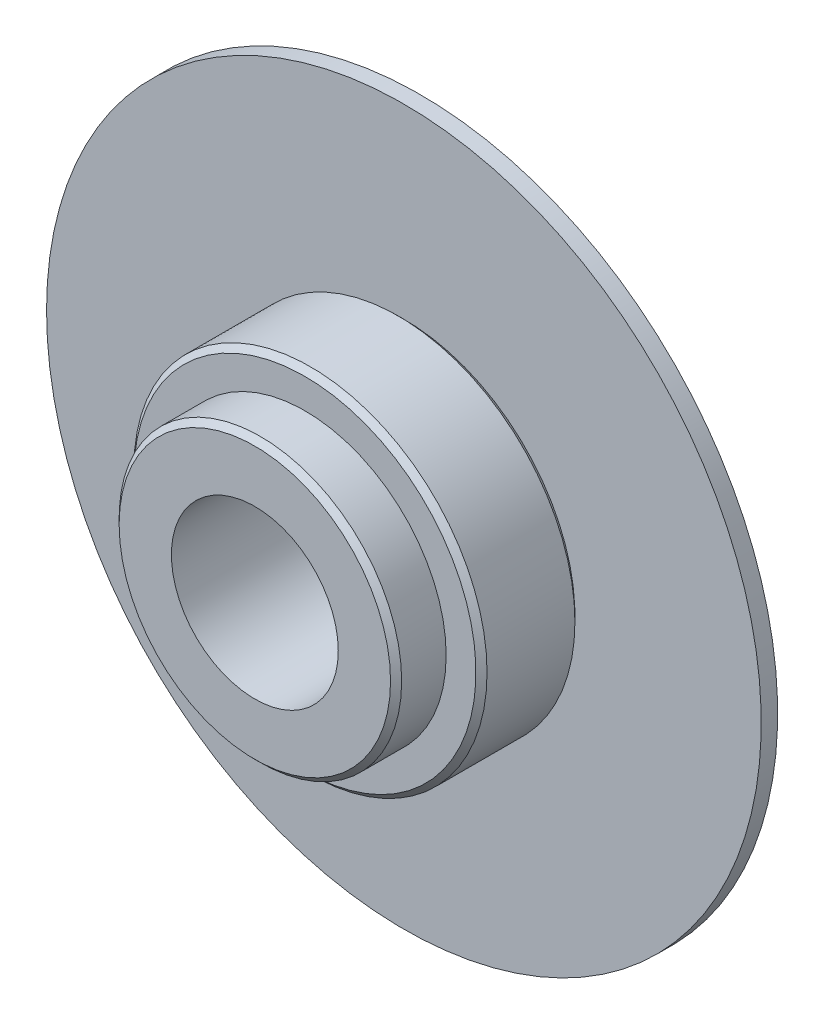
ISO-10303-21;
HEADER;
FILE_DESCRIPTION(('STEP AP214'),'2;1');
FILE_NAME('part.step','',(''),(''),'','','');
FILE_SCHEMA(('AUTOMOTIVE_DESIGN { 1 0 10303 214 1 1 1 1 }'));
ENDSEC;
DATA;
#1=APPLICATION_CONTEXT('core data for automotive mechanical design processes');
#2=APPLICATION_PROTOCOL_DEFINITION('international standard','automotive_design',2000,#1);
#3=PRODUCT_CONTEXT('',#1,'mechanical');
#4=PRODUCT('Part','Part','',(#3));
#5=PRODUCT_RELATED_PRODUCT_CATEGORY('part','',(#4));
#6=PRODUCT_DEFINITION_FORMATION('','',#4);
#7=PRODUCT_DEFINITION_CONTEXT('part definition',#1,'design');
#8=PRODUCT_DEFINITION('design','',#6,#7);
#9=PRODUCT_DEFINITION_SHAPE('','',#8);
#10=(LENGTH_UNIT() NAMED_UNIT(*) SI_UNIT(.MILLI.,.METRE.));
#11=(NAMED_UNIT(*) PLANE_ANGLE_UNIT() SI_UNIT($,.RADIAN.));
#12=(NAMED_UNIT(*) SI_UNIT($,.STERADIAN.) SOLID_ANGLE_UNIT());
#13=UNCERTAINTY_MEASURE_WITH_UNIT(LENGTH_MEASURE(1.E-05),#10,'distance_accuracy_value','');
#14=(GEOMETRIC_REPRESENTATION_CONTEXT(3) GLOBAL_UNCERTAINTY_ASSIGNED_CONTEXT((#13)) GLOBAL_UNIT_ASSIGNED_CONTEXT((#10,
#11,#12)) REPRESENTATION_CONTEXT('',''));
#15=CARTESIAN_POINT('',(0.,0.,0.));
#16=DIRECTION('',(0.,0.,1.));
#17=DIRECTION('',(1.,0.,0.));
#18=AXIS2_PLACEMENT_3D('',#15,#16,#17);
#19=CARTESIAN_POINT('',(0.,0.,-1.8));
#20=DIRECTION('',(0.,0.,1.));
#21=DIRECTION('',(1.,0.,0.));
#22=AXIS2_PLACEMENT_3D('',#19,#20,#21);
#23=CYLINDRICAL_SURFACE('',#22,5.08);
#24=CARTESIAN_POINT('',(0.,0.,-0.200000000000002));
#25=DIRECTION('',(0.,0.,1.));
#26=DIRECTION('',(1.,0.,0.));
#27=AXIS2_PLACEMENT_3D('',#24,#25,#26);
#28=CIRCLE('',#27,5.08);
#29=CARTESIAN_POINT('',(5.08,0.,-0.200000000000002));
#30=VERTEX_POINT('',#29);
#31=EDGE_CURVE('E47',#30,#30,#28,.F.);
#32=ORIENTED_EDGE('',*,*,#31,.T.);
#33=EDGE_LOOP('',(#32));
#34=FACE_BOUND('',#33,.T.);
#35=CARTESIAN_POINT('',(0.,0.,-1.8));
#36=DIRECTION('',(0.,0.,1.));
#37=DIRECTION('',(1.,0.,0.));
#38=AXIS2_PLACEMENT_3D('',#35,#36,#37);
#39=CIRCLE('',#38,5.08);
#40=CARTESIAN_POINT('',(5.08,0.,-1.8));
#41=VERTEX_POINT('',#40);
#42=EDGE_CURVE('E55',#41,#41,#39,.T.);
#43=ORIENTED_EDGE('',*,*,#42,.T.);
#44=EDGE_LOOP('',(#43));
#45=FACE_BOUND('',#44,.T.);
#46=ADVANCED_FACE('F34',(#34,#45),#23,.T.);
#47=CARTESIAN_POINT('',(0.,0.,0.));
#48=DIRECTION('',(0.,0.,1.));
#49=DIRECTION('',(1.,0.,0.));
#50=AXIS2_PLACEMENT_3D('',#47,#48,#49);
#51=PLANE('',#50);
#52=CARTESIAN_POINT('',(0.,0.,0.));
#53=DIRECTION('',(0.,0.,1.));
#54=DIRECTION('',(1.,0.,0.));
#55=AXIS2_PLACEMENT_3D('',#52,#53,#54);
#56=CIRCLE('',#55,3.);
#57=CARTESIAN_POINT('',(3.,0.,0.));
#58=VERTEX_POINT('',#57);
#59=EDGE_CURVE('E155',#58,#58,#56,.T.);
#60=ORIENTED_EDGE('',*,*,#59,.F.);
#61=EDGE_LOOP('',(#60));
#62=FACE_BOUND('',#61,.T.);
#63=CARTESIAN_POINT('',(0.,0.,0.));
#64=DIRECTION('',(0.,0.,1.));
#65=DIRECTION('',(1.,0.,0.));
#66=AXIS2_PLACEMENT_3D('',#63,#64,#65);
#67=CIRCLE('',#66,4.88);
#68=CARTESIAN_POINT('',(4.88,0.,0.));
#69=VERTEX_POINT('',#68);
#70=EDGE_CURVE('E70',#69,#69,#67,.T.);
#71=ORIENTED_EDGE('',*,*,#70,.T.);
#72=EDGE_LOOP('',(#71));
#73=FACE_BOUND('',#72,.T.);
#74=ADVANCED_FACE('F83',(#62,#73),#51,.T.);
#75=CARTESIAN_POINT('',(0.,0.,-5.36));
#76=DIRECTION('',(0.,0.,1.));
#77=DIRECTION('',(1.,0.,0.));
#78=AXIS2_PLACEMENT_3D('',#75,#76,#77);
#79=CYLINDRICAL_SURFACE('',#78,6.35);
#80=CARTESIAN_POINT('',(0.,0.,-5.16));
#81=DIRECTION('',(0.,0.,-1.));
#82=DIRECTION('',(-1.,0.,0.));
#83=AXIS2_PLACEMENT_3D('',#80,#81,#82);
#84=CIRCLE('',#83,6.35);
#85=CARTESIAN_POINT('',(-6.35,0.,-5.16));
#86=VERTEX_POINT('',#85);
#87=EDGE_CURVE('E67',#86,#86,#84,.F.);
#88=ORIENTED_EDGE('',*,*,#87,.T.);
#89=EDGE_LOOP('',(#88));
#90=FACE_BOUND('',#89,.T.);
#91=CARTESIAN_POINT('',(0.,0.,-2.));
#92=DIRECTION('',(0.,0.,-1.));
#93=DIRECTION('',(-1.,0.,0.));
#94=AXIS2_PLACEMENT_3D('',#91,#92,#93);
#95=CIRCLE('',#94,6.35);
#96=CARTESIAN_POINT('',(-6.35,0.,-2.));
#97=VERTEX_POINT('',#96);
#98=EDGE_CURVE('E64',#97,#97,#95,.T.);
#99=ORIENTED_EDGE('',*,*,#98,.T.);
#100=EDGE_LOOP('',(#99));
#101=FACE_BOUND('',#100,.T.);
#102=ADVANCED_FACE('F85',(#90,#101),#79,.T.);
#103=CARTESIAN_POINT('',(0.,0.,-1.8));
#104=DIRECTION('',(0.,0.,-1.));
#105=DIRECTION('',(-1.,0.,0.));
#106=AXIS2_PLACEMENT_3D('',#103,#104,#105);
#107=PLANE('',#106);
#108=CARTESIAN_POINT('',(0.,0.,-1.8));
#109=DIRECTION('',(0.,0.,-1.));
#110=DIRECTION('',(-1.,0.,0.));
#111=AXIS2_PLACEMENT_3D('',#108,#109,#110);
#112=CIRCLE('',#111,6.15);
#113=CARTESIAN_POINT('',(-6.15,0.,-1.8));
#114=VERTEX_POINT('',#113);
#115=EDGE_CURVE('E39',#114,#114,#112,.F.);
#116=ORIENTED_EDGE('',*,*,#115,.T.);
#117=EDGE_LOOP('',(#116));
#118=FACE_BOUND('',#117,.T.);
#119=ORIENTED_EDGE('',*,*,#42,.F.);
#120=EDGE_LOOP('',(#119));
#121=FACE_BOUND('',#120,.T.);
#122=ADVANCED_FACE('F92',(#118,#121),#107,.F.);
#123=CARTESIAN_POINT('',(0.,0.,-5.36));
#124=DIRECTION('',(0.,0.,1.));
#125=DIRECTION('',(1.,0.,0.));
#126=AXIS2_PLACEMENT_3D('',#123,#124,#125);
#127=CONICAL_SURFACE('',#126,6.15,0.78539816339745);
#128=ORIENTED_EDGE('',*,*,#87,.F.);
#129=EDGE_LOOP('',(#128));
#130=FACE_BOUND('',#129,.T.);
#131=CARTESIAN_POINT('',(0.,0.,-5.36));
#132=DIRECTION('',(0.,0.,-1.));
#133=DIRECTION('',(-1.,0.,0.));
#134=AXIS2_PLACEMENT_3D('',#131,#132,#133);
#135=CIRCLE('',#134,6.15);
#136=CARTESIAN_POINT('',(-6.15,0.,-5.36));
#137=VERTEX_POINT('',#136);
#138=EDGE_CURVE('E61',#137,#137,#135,.T.);
#139=ORIENTED_EDGE('',*,*,#138,.F.);
#140=EDGE_LOOP('',(#139));
#141=FACE_BOUND('',#140,.T.);
#142=ADVANCED_FACE('F80',(#130,#141),#127,.T.);
#143=CARTESIAN_POINT('',(0.,0.,0.));
#144=DIRECTION('',(0.,0.,-1.));
#145=DIRECTION('',(-1.,0.,0.));
#146=AXIS2_PLACEMENT_3D('',#143,#144,#145);
#147=CONICAL_SURFACE('',#146,4.88,0.785398163397442);
#148=ORIENTED_EDGE('',*,*,#31,.F.);
#149=EDGE_LOOP('',(#148));
#150=FACE_BOUND('',#149,.T.);
#151=ORIENTED_EDGE('',*,*,#70,.F.);
#152=EDGE_LOOP('',(#151));
#153=FACE_BOUND('',#152,.T.);
#154=ADVANCED_FACE('F77',(#150,#153),#147,.T.);
#155=CARTESIAN_POINT('',(0.,0.,-2.));
#156=DIRECTION('',(0.,0.,-1.));
#157=DIRECTION('',(-1.,0.,0.));
#158=AXIS2_PLACEMENT_3D('',#155,#156,#157);
#159=CONICAL_SURFACE('',#158,6.35,0.78539816339745);
#160=ORIENTED_EDGE('',*,*,#115,.F.);
#161=EDGE_LOOP('',(#160));
#162=FACE_BOUND('',#161,.T.);
#163=ORIENTED_EDGE('',*,*,#98,.F.);
#164=EDGE_LOOP('',(#163));
#165=FACE_BOUND('',#164,.T.);
#166=ADVANCED_FACE('F37',(#162,#165),#159,.T.);
#167=CARTESIAN_POINT('',(0.,0.,-5.95));
#168=DIRECTION('',(0.,0.,1.));
#169=DIRECTION('',(1.,0.,0.));
#170=AXIS2_PLACEMENT_3D('',#167,#168,#169);
#171=CYLINDRICAL_SURFACE('',#170,12.85);
#172=CARTESIAN_POINT('',(0.,0.,-5.95));
#173=DIRECTION('',(0.,0.,-1.));
#174=DIRECTION('',(-1.,0.,0.));
#175=AXIS2_PLACEMENT_3D('',#172,#173,#174);
#176=CIRCLE('',#175,12.85);
#177=CARTESIAN_POINT('',(-12.85,0.,-5.95));
#178=VERTEX_POINT('',#177);
#179=EDGE_CURVE('E52',#178,#178,#176,.T.);
#180=ORIENTED_EDGE('',*,*,#179,.F.);
#181=EDGE_LOOP('',(#180));
#182=FACE_BOUND('',#181,.T.);
#183=CARTESIAN_POINT('',(0.,0.,-5.36));
#184=DIRECTION('',(0.,0.,-1.));
#185=DIRECTION('',(-1.,0.,0.));
#186=AXIS2_PLACEMENT_3D('',#183,#184,#185);
#187=CIRCLE('',#186,12.85);
#188=CARTESIAN_POINT('',(-12.85,0.,-5.36));
#189=VERTEX_POINT('',#188);
#190=EDGE_CURVE('E56',#189,#189,#187,.T.);
#191=ORIENTED_EDGE('',*,*,#190,.T.);
#192=EDGE_LOOP('',(#191));
#193=FACE_BOUND('',#192,.T.);
#194=ADVANCED_FACE('F125',(#182,#193),#171,.T.);
#195=CARTESIAN_POINT('',(0.,0.,-5.95));
#196=DIRECTION('',(0.,0.,-1.));
#197=DIRECTION('',(-1.,0.,0.));
#198=AXIS2_PLACEMENT_3D('',#195,#196,#197);
#199=PLANE('',#198);
#200=CARTESIAN_POINT('',(0.,0.,-5.95));
#201=DIRECTION('',(0.,0.,-1.));
#202=DIRECTION('',(-1.,0.,0.));
#203=AXIS2_PLACEMENT_3D('',#200,#201,#202);
#204=CIRCLE('',#203,5.);
#205=CARTESIAN_POINT('',(-5.,0.,-5.95));
#206=VERTEX_POINT('',#205);
#207=EDGE_CURVE('E10',#206,#206,#204,.T.);
#208=ORIENTED_EDGE('',*,*,#207,.F.);
#209=EDGE_LOOP('',(#208));
#210=FACE_BOUND('',#209,.T.);
#211=ORIENTED_EDGE('',*,*,#179,.T.);
#212=EDGE_LOOP('',(#211));
#213=FACE_BOUND('',#212,.T.);
#214=ADVANCED_FACE('F121',(#210,#213),#199,.T.);
#215=CARTESIAN_POINT('',(0.,0.,-5.36));
#216=DIRECTION('',(0.,0.,-1.));
#217=DIRECTION('',(-1.,0.,0.));
#218=AXIS2_PLACEMENT_3D('',#215,#216,#217);
#219=PLANE('',#218);
#220=ORIENTED_EDGE('',*,*,#138,.T.);
#221=EDGE_LOOP('',(#220));
#222=FACE_BOUND('',#221,.T.);
#223=ORIENTED_EDGE('',*,*,#190,.F.);
#224=EDGE_LOOP('',(#223));
#225=FACE_BOUND('',#224,.T.);
#226=ADVANCED_FACE('F117',(#222,#225),#219,.F.);
#227=CARTESIAN_POINT('',(0.,0.,-6.45));
#228=DIRECTION('',(0.,0.,1.));
#229=DIRECTION('',(1.,0.,0.));
#230=AXIS2_PLACEMENT_3D('',#227,#228,#229);
#231=CYLINDRICAL_SURFACE('',#230,5.);
#232=CARTESIAN_POINT('',(0.,0.,-6.45));
#233=DIRECTION('',(0.,0.,-1.));
#234=DIRECTION('',(-1.,0.,0.));
#235=AXIS2_PLACEMENT_3D('',#232,#233,#234);
#236=CIRCLE('',#235,5.);
#237=CARTESIAN_POINT('',(-5.,0.,-6.45));
#238=VERTEX_POINT('',#237);
#239=EDGE_CURVE('E50',#238,#238,#236,.T.);
#240=ORIENTED_EDGE('',*,*,#239,.F.);
#241=EDGE_LOOP('',(#240));
#242=FACE_BOUND('',#241,.T.);
#243=ORIENTED_EDGE('',*,*,#207,.T.);
#244=EDGE_LOOP('',(#243));
#245=FACE_BOUND('',#244,.T.);
#246=ADVANCED_FACE('F120',(#242,#245),#231,.T.);
#247=CARTESIAN_POINT('',(0.,0.,-6.45));
#248=DIRECTION('',(0.,0.,-1.));
#249=DIRECTION('',(-1.,0.,0.));
#250=AXIS2_PLACEMENT_3D('',#247,#248,#249);
#251=PLANE('',#250);
#252=CARTESIAN_POINT('',(0.,0.,-6.45));
#253=DIRECTION('',(0.,0.,1.));
#254=DIRECTION('',(1.,0.,0.));
#255=AXIS2_PLACEMENT_3D('',#252,#253,#254);
#256=CIRCLE('',#255,3.);
#257=CARTESIAN_POINT('',(3.,0.,-6.45));
#258=VERTEX_POINT('',#257);
#259=EDGE_CURVE('E153',#258,#258,#256,.T.);
#260=ORIENTED_EDGE('',*,*,#259,.T.);
#261=EDGE_LOOP('',(#260));
#262=FACE_BOUND('',#261,.T.);
#263=ORIENTED_EDGE('',*,*,#239,.T.);
#264=EDGE_LOOP('',(#263));
#265=FACE_BOUND('',#264,.T.);
#266=ADVANCED_FACE('F140',(#262,#265),#251,.T.);
#267=CARTESIAN_POINT('',(0.,0.,-6.45));
#268=DIRECTION('',(0.,0.,1.));
#269=DIRECTION('',(1.,0.,0.));
#270=AXIS2_PLACEMENT_3D('',#267,#268,#269);
#271=CYLINDRICAL_SURFACE('',#270,3.);
#272=ORIENTED_EDGE('',*,*,#259,.F.);
#273=EDGE_LOOP('',(#272));
#274=FACE_BOUND('',#273,.T.);
#275=ORIENTED_EDGE('',*,*,#59,.T.);
#276=EDGE_LOOP('',(#275));
#277=FACE_BOUND('',#276,.T.);
#278=ADVANCED_FACE('F144',(#274,#277),#271,.F.);
#279=CLOSED_SHELL('',(#46,#74,#102,#122,#142,#154,#166,#194,#214,#226,#246,#266,#278));
#280=MANIFOLD_SOLID_BREP('B2',#279);
#281=ADVANCED_BREP_SHAPE_REPRESENTATION('',(#18,#280),#14);
#282=SHAPE_DEFINITION_REPRESENTATION(#9,#281);
ENDSEC;
END-ISO-10303-21;
